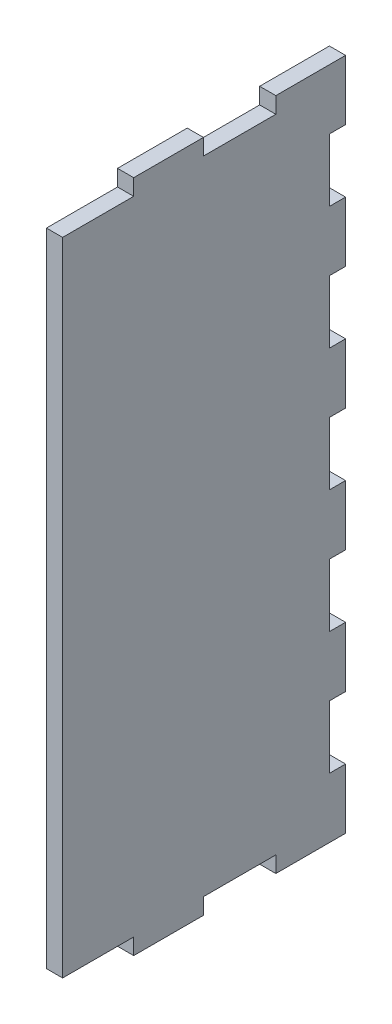
ISO-10303-21;
HEADER;
FILE_DESCRIPTION(('STEP AP214'),'2;1');
FILE_NAME('part.step','',(''),(''),'','','');
FILE_SCHEMA(('AUTOMOTIVE_DESIGN { 1 0 10303 214 1 1 1 1 }'));
ENDSEC;
DATA;
#1=APPLICATION_CONTEXT('core data for automotive mechanical design processes');
#2=APPLICATION_PROTOCOL_DEFINITION('international standard','automotive_design',2000,#1);
#3=PRODUCT_CONTEXT('',#1,'mechanical');
#4=PRODUCT('Part','Part','',(#3));
#5=PRODUCT_RELATED_PRODUCT_CATEGORY('part','',(#4));
#6=PRODUCT_DEFINITION_FORMATION('','',#4);
#7=PRODUCT_DEFINITION_CONTEXT('part definition',#1,'design');
#8=PRODUCT_DEFINITION('design','',#6,#7);
#9=PRODUCT_DEFINITION_SHAPE('','',#8);
#10=(LENGTH_UNIT() NAMED_UNIT(*) SI_UNIT(.MILLI.,.METRE.));
#11=(NAMED_UNIT(*) PLANE_ANGLE_UNIT() SI_UNIT($,.RADIAN.));
#12=(NAMED_UNIT(*) SI_UNIT($,.STERADIAN.) SOLID_ANGLE_UNIT());
#13=UNCERTAINTY_MEASURE_WITH_UNIT(LENGTH_MEASURE(1.E-05),#10,'distance_accuracy_value','');
#14=(GEOMETRIC_REPRESENTATION_CONTEXT(3) GLOBAL_UNCERTAINTY_ASSIGNED_CONTEXT((#13)) GLOBAL_UNIT_ASSIGNED_CONTEXT((#10,
#11,#12)) REPRESENTATION_CONTEXT('',''));
#15=CARTESIAN_POINT('',(0.,0.,0.));
#16=DIRECTION('',(0.,0.,1.));
#17=DIRECTION('',(1.,0.,0.));
#18=AXIS2_PLACEMENT_3D('',#15,#16,#17);
#19=CARTESIAN_POINT('',(324.,244.,25.875));
#20=DIRECTION('',(0.,1.,0.));
#21=DIRECTION('',(0.,0.,1.));
#22=AXIS2_PLACEMENT_3D('',#19,#20,#21);
#23=PLANE('',#22);
#24=DIRECTION('',(0.,0.,1.));
#25=VECTOR('',#24,1.);
#26=CARTESIAN_POINT('',(330.,244.,25.875));
#27=LINE('',#26,#25);
#28=CARTESIAN_POINT('',(330.,244.,25.875));
#29=VERTEX_POINT('',#28);
#30=CARTESIAN_POINT('',(330.,244.,52.75));
#31=VERTEX_POINT('',#30);
#32=EDGE_CURVE('E306',#29,#31,#27,.T.);
#33=ORIENTED_EDGE('',*,*,#32,.F.);
#34=DIRECTION('',(1.,0.,0.));
#35=VECTOR('',#34,1.);
#36=CARTESIAN_POINT('',(324.,244.,25.875));
#37=LINE('',#36,#35);
#38=CARTESIAN_POINT('',(324.,244.,25.875));
#39=VERTEX_POINT('',#38);
#40=EDGE_CURVE('E11',#39,#29,#37,.T.);
#41=ORIENTED_EDGE('',*,*,#40,.F.);
#42=DIRECTION('',(0.,0.,1.));
#43=VECTOR('',#42,1.);
#44=CARTESIAN_POINT('',(324.,244.,25.875));
#45=LINE('',#44,#43);
#46=CARTESIAN_POINT('',(324.,244.,52.75));
#47=VERTEX_POINT('',#46);
#48=EDGE_CURVE('E410',#39,#47,#45,.T.);
#49=ORIENTED_EDGE('',*,*,#48,.T.);
#50=DIRECTION('',(1.,0.,0.));
#51=VECTOR('',#50,1.);
#52=CARTESIAN_POINT('',(324.,244.,52.75));
#53=LINE('',#52,#51);
#54=EDGE_CURVE('E44',#47,#31,#53,.T.);
#55=ORIENTED_EDGE('',*,*,#54,.T.);
#56=EDGE_LOOP('',(#33,#41,#49,#55));
#57=FACE_BOUND('',#56,.T.);
#58=ADVANCED_FACE('F41',(#57),#23,.T.);
#59=CARTESIAN_POINT('',(324.,250.,25.875));
#60=DIRECTION('',(0.,0.,1.));
#61=DIRECTION('',(1.,0.,0.));
#62=AXIS2_PLACEMENT_3D('',#59,#60,#61);
#63=PLANE('',#62);
#64=DIRECTION('',(0.,-1.,0.));
#65=VECTOR('',#64,1.);
#66=CARTESIAN_POINT('',(330.,250.,25.875));
#67=LINE('',#66,#65);
#68=CARTESIAN_POINT('',(330.,250.,25.875));
#69=VERTEX_POINT('',#68);
#70=EDGE_CURVE('E408',#69,#29,#67,.T.);
#71=ORIENTED_EDGE('',*,*,#70,.F.);
#72=DIRECTION('',(1.,0.,0.));
#73=VECTOR('',#72,1.);
#74=CARTESIAN_POINT('',(324.,250.,25.875));
#75=LINE('',#74,#73);
#76=CARTESIAN_POINT('',(324.,250.,25.875));
#77=VERTEX_POINT('',#76);
#78=EDGE_CURVE('E50',#77,#69,#75,.T.);
#79=ORIENTED_EDGE('',*,*,#78,.F.);
#80=DIRECTION('',(0.,-1.,0.));
#81=VECTOR('',#80,1.);
#82=CARTESIAN_POINT('',(324.,250.,25.875));
#83=LINE('',#82,#81);
#84=EDGE_CURVE('E296',#77,#39,#83,.T.);
#85=ORIENTED_EDGE('',*,*,#84,.T.);
#86=ORIENTED_EDGE('',*,*,#40,.T.);
#87=EDGE_LOOP('',(#71,#79,#85,#86));
#88=FACE_BOUND('',#87,.T.);
#89=ADVANCED_FACE('F478',(#88),#63,.T.);
#90=CARTESIAN_POINT('',(324.,250.,0.));
#91=DIRECTION('',(0.,1.,0.));
#92=DIRECTION('',(0.,0.,1.));
#93=AXIS2_PLACEMENT_3D('',#90,#91,#92);
#94=PLANE('',#93);
#95=DIRECTION('',(0.,0.,1.));
#96=VECTOR('',#95,1.);
#97=CARTESIAN_POINT('',(330.,250.,0.));
#98=LINE('',#97,#96);
#99=CARTESIAN_POINT('',(330.,250.,0.));
#100=VERTEX_POINT('',#99);
#101=EDGE_CURVE('E283',#100,#69,#98,.T.);
#102=ORIENTED_EDGE('',*,*,#101,.F.);
#103=DIRECTION('',(1.,0.,0.));
#104=VECTOR('',#103,1.);
#105=CARTESIAN_POINT('',(324.,250.,0.));
#106=LINE('',#105,#104);
#107=CARTESIAN_POINT('',(324.,250.,0.));
#108=VERTEX_POINT('',#107);
#109=EDGE_CURVE('E278',#108,#100,#106,.T.);
#110=ORIENTED_EDGE('',*,*,#109,.F.);
#111=DIRECTION('',(0.,0.,1.));
#112=VECTOR('',#111,1.);
#113=CARTESIAN_POINT('',(324.,250.,0.));
#114=LINE('',#113,#112);
#115=EDGE_CURVE('E281',#108,#77,#114,.T.);
#116=ORIENTED_EDGE('',*,*,#115,.T.);
#117=ORIENTED_EDGE('',*,*,#78,.T.);
#118=EDGE_LOOP('',(#102,#110,#116,#117));
#119=FACE_BOUND('',#118,.T.);
#120=ADVANCED_FACE('F280',(#119),#94,.T.);
#121=CARTESIAN_POINT('',(324.,227.727272727273,0.));
#122=DIRECTION('',(0.,0.,-1.));
#123=DIRECTION('',(-1.,0.,0.));
#124=AXIS2_PLACEMENT_3D('',#121,#122,#123);
#125=PLANE('',#124);
#126=DIRECTION('',(0.,1.,0.));
#127=VECTOR('',#126,1.);
#128=CARTESIAN_POINT('',(330.,227.727272727273,0.));
#129=LINE('',#128,#127);
#130=CARTESIAN_POINT('',(330.,227.727272727273,0.));
#131=VERTEX_POINT('',#130);
#132=EDGE_CURVE('E405',#131,#100,#129,.T.);
#133=ORIENTED_EDGE('',*,*,#132,.F.);
#134=DIRECTION('',(1.,0.,0.));
#135=VECTOR('',#134,1.);
#136=CARTESIAN_POINT('',(324.,227.727272727273,0.));
#137=LINE('',#136,#135);
#138=CARTESIAN_POINT('',(324.,227.727272727273,0.));
#139=VERTEX_POINT('',#138);
#140=EDGE_CURVE('E288',#139,#131,#137,.T.);
#141=ORIENTED_EDGE('',*,*,#140,.F.);
#142=DIRECTION('',(0.,1.,0.));
#143=VECTOR('',#142,1.);
#144=CARTESIAN_POINT('',(324.,227.727272727273,0.));
#145=LINE('',#144,#143);
#146=EDGE_CURVE('E294',#139,#108,#145,.T.);
#147=ORIENTED_EDGE('',*,*,#146,.T.);
#148=ORIENTED_EDGE('',*,*,#109,.T.);
#149=EDGE_LOOP('',(#133,#141,#147,#148));
#150=FACE_BOUND('',#149,.T.);
#151=ADVANCED_FACE('F298',(#150),#125,.T.);
#152=CARTESIAN_POINT('',(324.,227.727272727273,6.));
#153=DIRECTION('',(0.,-1.,0.));
#154=DIRECTION('',(0.,0.,-1.));
#155=AXIS2_PLACEMENT_3D('',#152,#153,#154);
#156=PLANE('',#155);
#157=DIRECTION('',(0.,0.,-1.));
#158=VECTOR('',#157,1.);
#159=CARTESIAN_POINT('',(330.,227.727272727273,6.));
#160=LINE('',#159,#158);
#161=CARTESIAN_POINT('',(330.,227.727272727273,6.));
#162=VERTEX_POINT('',#161);
#163=EDGE_CURVE('E402',#162,#131,#160,.T.);
#164=ORIENTED_EDGE('',*,*,#163,.F.);
#165=DIRECTION('',(1.,0.,0.));
#166=VECTOR('',#165,1.);
#167=CARTESIAN_POINT('',(324.,227.727272727273,6.));
#168=LINE('',#167,#166);
#169=CARTESIAN_POINT('',(324.,227.727272727273,6.));
#170=VERTEX_POINT('',#169);
#171=EDGE_CURVE('E414',#170,#162,#168,.T.);
#172=ORIENTED_EDGE('',*,*,#171,.F.);
#173=DIRECTION('',(0.,0.,-1.));
#174=VECTOR('',#173,1.);
#175=CARTESIAN_POINT('',(324.,227.727272727273,6.));
#176=LINE('',#175,#174);
#177=EDGE_CURVE('E299',#170,#139,#176,.T.);
#178=ORIENTED_EDGE('',*,*,#177,.T.);
#179=ORIENTED_EDGE('',*,*,#140,.T.);
#180=EDGE_LOOP('',(#164,#172,#178,#179));
#181=FACE_BOUND('',#180,.T.);
#182=ADVANCED_FACE('F491',(#181),#156,.T.);
#183=CARTESIAN_POINT('',(324.,204.454545454545,6.));
#184=DIRECTION('',(0.,0.,-1.));
#185=DIRECTION('',(-1.,0.,0.));
#186=AXIS2_PLACEMENT_3D('',#183,#184,#185);
#187=PLANE('',#186);
#188=DIRECTION('',(0.,1.,0.));
#189=VECTOR('',#188,1.);
#190=CARTESIAN_POINT('',(330.,204.454545454545,6.));
#191=LINE('',#190,#189);
#192=CARTESIAN_POINT('',(330.,204.454545454545,6.));
#193=VERTEX_POINT('',#192);
#194=EDGE_CURVE('E399',#193,#162,#191,.T.);
#195=ORIENTED_EDGE('',*,*,#194,.F.);
#196=DIRECTION('',(1.,0.,0.));
#197=VECTOR('',#196,1.);
#198=CARTESIAN_POINT('',(324.,204.454545454545,6.));
#199=LINE('',#198,#197);
#200=CARTESIAN_POINT('',(324.,204.454545454545,6.));
#201=VERTEX_POINT('',#200);
#202=EDGE_CURVE('E416',#201,#193,#199,.T.);
#203=ORIENTED_EDGE('',*,*,#202,.F.);
#204=DIRECTION('',(0.,1.,0.));
#205=VECTOR('',#204,1.);
#206=CARTESIAN_POINT('',(324.,204.454545454545,6.));
#207=LINE('',#206,#205);
#208=EDGE_CURVE('E301',#201,#170,#207,.T.);
#209=ORIENTED_EDGE('',*,*,#208,.T.);
#210=ORIENTED_EDGE('',*,*,#171,.T.);
#211=EDGE_LOOP('',(#195,#203,#209,#210));
#212=FACE_BOUND('',#211,.T.);
#213=ADVANCED_FACE('F494',(#212),#187,.T.);
#214=CARTESIAN_POINT('',(324.,204.454545454545,0.));
#215=DIRECTION('',(0.,1.,0.));
#216=DIRECTION('',(0.,0.,1.));
#217=AXIS2_PLACEMENT_3D('',#214,#215,#216);
#218=PLANE('',#217);
#219=DIRECTION('',(0.,0.,1.));
#220=VECTOR('',#219,1.);
#221=CARTESIAN_POINT('',(330.,204.454545454545,0.));
#222=LINE('',#221,#220);
#223=CARTESIAN_POINT('',(330.,204.454545454545,0.));
#224=VERTEX_POINT('',#223);
#225=EDGE_CURVE('E396',#224,#193,#222,.T.);
#226=ORIENTED_EDGE('',*,*,#225,.F.);
#227=DIRECTION('',(1.,0.,0.));
#228=VECTOR('',#227,1.);
#229=CARTESIAN_POINT('',(324.,204.454545454545,0.));
#230=LINE('',#229,#228);
#231=CARTESIAN_POINT('',(324.,204.454545454545,0.));
#232=VERTEX_POINT('',#231);
#233=EDGE_CURVE('E418',#232,#224,#230,.T.);
#234=ORIENTED_EDGE('',*,*,#233,.F.);
#235=DIRECTION('',(0.,0.,1.));
#236=VECTOR('',#235,1.);
#237=CARTESIAN_POINT('',(324.,204.454545454545,0.));
#238=LINE('',#237,#236);
#239=EDGE_CURVE('E948',#232,#201,#238,.T.);
#240=ORIENTED_EDGE('',*,*,#239,.T.);
#241=ORIENTED_EDGE('',*,*,#202,.T.);
#242=EDGE_LOOP('',(#226,#234,#240,#241));
#243=FACE_BOUND('',#242,.T.);
#244=ADVANCED_FACE('F498',(#243),#218,.T.);
#245=CARTESIAN_POINT('',(324.,182.181818181818,0.));
#246=DIRECTION('',(0.,0.,-1.));
#247=DIRECTION('',(-1.,0.,0.));
#248=AXIS2_PLACEMENT_3D('',#245,#246,#247);
#249=PLANE('',#248);
#250=DIRECTION('',(0.,1.,0.));
#251=VECTOR('',#250,1.);
#252=CARTESIAN_POINT('',(330.,182.181818181818,0.));
#253=LINE('',#252,#251);
#254=CARTESIAN_POINT('',(330.,182.181818181818,0.));
#255=VERTEX_POINT('',#254);
#256=EDGE_CURVE('E393',#255,#224,#253,.T.);
#257=ORIENTED_EDGE('',*,*,#256,.F.);
#258=DIRECTION('',(1.,0.,0.));
#259=VECTOR('',#258,1.);
#260=CARTESIAN_POINT('',(324.,182.181818181818,0.));
#261=LINE('',#260,#259);
#262=CARTESIAN_POINT('',(324.,182.181818181818,0.));
#263=VERTEX_POINT('',#262);
#264=EDGE_CURVE('E420',#263,#255,#261,.T.);
#265=ORIENTED_EDGE('',*,*,#264,.F.);
#266=DIRECTION('',(0.,1.,0.));
#267=VECTOR('',#266,1.);
#268=CARTESIAN_POINT('',(324.,182.181818181818,0.));
#269=LINE('',#268,#267);
#270=EDGE_CURVE('E952',#263,#232,#269,.T.);
#271=ORIENTED_EDGE('',*,*,#270,.T.);
#272=ORIENTED_EDGE('',*,*,#233,.T.);
#273=EDGE_LOOP('',(#257,#265,#271,#272));
#274=FACE_BOUND('',#273,.T.);
#275=ADVANCED_FACE('F502',(#274),#249,.T.);
#276=CARTESIAN_POINT('',(324.,182.181818181818,6.));
#277=DIRECTION('',(0.,-1.,0.));
#278=DIRECTION('',(0.,0.,-1.));
#279=AXIS2_PLACEMENT_3D('',#276,#277,#278);
#280=PLANE('',#279);
#281=DIRECTION('',(0.,0.,-1.));
#282=VECTOR('',#281,1.);
#283=CARTESIAN_POINT('',(330.,182.181818181818,6.));
#284=LINE('',#283,#282);
#285=CARTESIAN_POINT('',(330.,182.181818181818,6.));
#286=VERTEX_POINT('',#285);
#287=EDGE_CURVE('E390',#286,#255,#284,.T.);
#288=ORIENTED_EDGE('',*,*,#287,.F.);
#289=DIRECTION('',(1.,0.,0.));
#290=VECTOR('',#289,1.);
#291=CARTESIAN_POINT('',(324.,182.181818181818,6.));
#292=LINE('',#291,#290);
#293=CARTESIAN_POINT('',(324.,182.181818181818,6.));
#294=VERTEX_POINT('',#293);
#295=EDGE_CURVE('E422',#294,#286,#292,.T.);
#296=ORIENTED_EDGE('',*,*,#295,.F.);
#297=DIRECTION('',(0.,0.,-1.));
#298=VECTOR('',#297,1.);
#299=CARTESIAN_POINT('',(324.,182.181818181818,6.));
#300=LINE('',#299,#298);
#301=EDGE_CURVE('E941',#294,#263,#300,.T.);
#302=ORIENTED_EDGE('',*,*,#301,.T.);
#303=ORIENTED_EDGE('',*,*,#264,.T.);
#304=EDGE_LOOP('',(#288,#296,#302,#303));
#305=FACE_BOUND('',#304,.T.);
#306=ADVANCED_FACE('F506',(#305),#280,.T.);
#307=CARTESIAN_POINT('',(324.,158.909090909091,6.));
#308=DIRECTION('',(0.,0.,-1.));
#309=DIRECTION('',(-1.,0.,0.));
#310=AXIS2_PLACEMENT_3D('',#307,#308,#309);
#311=PLANE('',#310);
#312=DIRECTION('',(0.,1.,0.));
#313=VECTOR('',#312,1.);
#314=CARTESIAN_POINT('',(330.,158.909090909091,6.));
#315=LINE('',#314,#313);
#316=CARTESIAN_POINT('',(330.,158.909090909091,6.));
#317=VERTEX_POINT('',#316);
#318=EDGE_CURVE('E387',#317,#286,#315,.T.);
#319=ORIENTED_EDGE('',*,*,#318,.F.);
#320=DIRECTION('',(1.,0.,0.));
#321=VECTOR('',#320,1.);
#322=CARTESIAN_POINT('',(324.,158.909090909091,6.));
#323=LINE('',#322,#321);
#324=CARTESIAN_POINT('',(324.,158.909090909091,6.));
#325=VERTEX_POINT('',#324);
#326=EDGE_CURVE('E424',#325,#317,#323,.T.);
#327=ORIENTED_EDGE('',*,*,#326,.F.);
#328=DIRECTION('',(0.,1.,0.));
#329=VECTOR('',#328,1.);
#330=CARTESIAN_POINT('',(324.,158.909090909091,6.));
#331=LINE('',#330,#329);
#332=EDGE_CURVE('E937',#325,#294,#331,.T.);
#333=ORIENTED_EDGE('',*,*,#332,.T.);
#334=ORIENTED_EDGE('',*,*,#295,.T.);
#335=EDGE_LOOP('',(#319,#327,#333,#334));
#336=FACE_BOUND('',#335,.T.);
#337=ADVANCED_FACE('F510',(#336),#311,.T.);
#338=CARTESIAN_POINT('',(324.,158.909090909091,0.));
#339=DIRECTION('',(0.,1.,0.));
#340=DIRECTION('',(0.,0.,1.));
#341=AXIS2_PLACEMENT_3D('',#338,#339,#340);
#342=PLANE('',#341);
#343=DIRECTION('',(0.,0.,1.));
#344=VECTOR('',#343,1.);
#345=CARTESIAN_POINT('',(330.,158.909090909091,0.));
#346=LINE('',#345,#344);
#347=CARTESIAN_POINT('',(330.,158.909090909091,0.));
#348=VERTEX_POINT('',#347);
#349=EDGE_CURVE('E384',#348,#317,#346,.T.);
#350=ORIENTED_EDGE('',*,*,#349,.F.);
#351=DIRECTION('',(1.,0.,0.));
#352=VECTOR('',#351,1.);
#353=CARTESIAN_POINT('',(324.,158.909090909091,0.));
#354=LINE('',#353,#352);
#355=CARTESIAN_POINT('',(324.,158.909090909091,0.));
#356=VERTEX_POINT('',#355);
#357=EDGE_CURVE('E426',#356,#348,#354,.T.);
#358=ORIENTED_EDGE('',*,*,#357,.F.);
#359=DIRECTION('',(0.,0.,1.));
#360=VECTOR('',#359,1.);
#361=CARTESIAN_POINT('',(324.,158.909090909091,0.));
#362=LINE('',#361,#360);
#363=EDGE_CURVE('E958',#356,#325,#362,.T.);
#364=ORIENTED_EDGE('',*,*,#363,.T.);
#365=ORIENTED_EDGE('',*,*,#326,.T.);
#366=EDGE_LOOP('',(#350,#358,#364,#365));
#367=FACE_BOUND('',#366,.T.);
#368=ADVANCED_FACE('F514',(#367),#342,.T.);
#369=CARTESIAN_POINT('',(324.,136.636363636364,0.));
#370=DIRECTION('',(0.,0.,-1.));
#371=DIRECTION('',(-1.,0.,0.));
#372=AXIS2_PLACEMENT_3D('',#369,#370,#371);
#373=PLANE('',#372);
#374=DIRECTION('',(0.,1.,0.));
#375=VECTOR('',#374,1.);
#376=CARTESIAN_POINT('',(330.,136.636363636364,0.));
#377=LINE('',#376,#375);
#378=CARTESIAN_POINT('',(330.,136.636363636364,0.));
#379=VERTEX_POINT('',#378);
#380=EDGE_CURVE('E381',#379,#348,#377,.T.);
#381=ORIENTED_EDGE('',*,*,#380,.F.);
#382=DIRECTION('',(1.,0.,0.));
#383=VECTOR('',#382,1.);
#384=CARTESIAN_POINT('',(324.,136.636363636364,0.));
#385=LINE('',#384,#383);
#386=CARTESIAN_POINT('',(324.,136.636363636364,0.));
#387=VERTEX_POINT('',#386);
#388=EDGE_CURVE('E428',#387,#379,#385,.T.);
#389=ORIENTED_EDGE('',*,*,#388,.F.);
#390=DIRECTION('',(0.,1.,0.));
#391=VECTOR('',#390,1.);
#392=CARTESIAN_POINT('',(324.,136.636363636364,0.));
#393=LINE('',#392,#391);
#394=EDGE_CURVE('E930',#387,#356,#393,.T.);
#395=ORIENTED_EDGE('',*,*,#394,.T.);
#396=ORIENTED_EDGE('',*,*,#357,.T.);
#397=EDGE_LOOP('',(#381,#389,#395,#396));
#398=FACE_BOUND('',#397,.T.);
#399=ADVANCED_FACE('F518',(#398),#373,.T.);
#400=CARTESIAN_POINT('',(324.,136.636363636364,6.));
#401=DIRECTION('',(0.,-1.,0.));
#402=DIRECTION('',(0.,0.,-1.));
#403=AXIS2_PLACEMENT_3D('',#400,#401,#402);
#404=PLANE('',#403);
#405=DIRECTION('',(0.,0.,-1.));
#406=VECTOR('',#405,1.);
#407=CARTESIAN_POINT('',(330.,136.636363636364,6.));
#408=LINE('',#407,#406);
#409=CARTESIAN_POINT('',(330.,136.636363636364,6.));
#410=VERTEX_POINT('',#409);
#411=EDGE_CURVE('E378',#410,#379,#408,.T.);
#412=ORIENTED_EDGE('',*,*,#411,.F.);
#413=DIRECTION('',(1.,0.,0.));
#414=VECTOR('',#413,1.);
#415=CARTESIAN_POINT('',(324.,136.636363636364,6.));
#416=LINE('',#415,#414);
#417=CARTESIAN_POINT('',(324.,136.636363636364,6.));
#418=VERTEX_POINT('',#417);
#419=EDGE_CURVE('E430',#418,#410,#416,.T.);
#420=ORIENTED_EDGE('',*,*,#419,.F.);
#421=DIRECTION('',(0.,0.,-1.));
#422=VECTOR('',#421,1.);
#423=CARTESIAN_POINT('',(324.,136.636363636364,6.));
#424=LINE('',#423,#422);
#425=EDGE_CURVE('E926',#418,#387,#424,.T.);
#426=ORIENTED_EDGE('',*,*,#425,.T.);
#427=ORIENTED_EDGE('',*,*,#388,.T.);
#428=EDGE_LOOP('',(#412,#420,#426,#427));
#429=FACE_BOUND('',#428,.T.);
#430=ADVANCED_FACE('F522',(#429),#404,.T.);
#431=CARTESIAN_POINT('',(324.,113.363636363636,6.));
#432=DIRECTION('',(0.,0.,-1.));
#433=DIRECTION('',(-1.,0.,0.));
#434=AXIS2_PLACEMENT_3D('',#431,#432,#433);
#435=PLANE('',#434);
#436=DIRECTION('',(0.,1.,0.));
#437=VECTOR('',#436,1.);
#438=CARTESIAN_POINT('',(330.,113.363636363636,6.));
#439=LINE('',#438,#437);
#440=CARTESIAN_POINT('',(330.,113.363636363636,6.));
#441=VERTEX_POINT('',#440);
#442=EDGE_CURVE('E375',#441,#410,#439,.T.);
#443=ORIENTED_EDGE('',*,*,#442,.F.);
#444=DIRECTION('',(1.,0.,0.));
#445=VECTOR('',#444,1.);
#446=CARTESIAN_POINT('',(324.,113.363636363636,6.));
#447=LINE('',#446,#445);
#448=CARTESIAN_POINT('',(324.,113.363636363636,6.));
#449=VERTEX_POINT('',#448);
#450=EDGE_CURVE('E432',#449,#441,#447,.T.);
#451=ORIENTED_EDGE('',*,*,#450,.F.);
#452=DIRECTION('',(0.,1.,0.));
#453=VECTOR('',#452,1.);
#454=CARTESIAN_POINT('',(324.,113.363636363636,6.));
#455=LINE('',#454,#453);
#456=EDGE_CURVE('E962',#449,#418,#455,.T.);
#457=ORIENTED_EDGE('',*,*,#456,.T.);
#458=ORIENTED_EDGE('',*,*,#419,.T.);
#459=EDGE_LOOP('',(#443,#451,#457,#458));
#460=FACE_BOUND('',#459,.T.);
#461=ADVANCED_FACE('F526',(#460),#435,.T.);
#462=CARTESIAN_POINT('',(324.,113.363636363636,0.));
#463=DIRECTION('',(0.,1.,0.));
#464=DIRECTION('',(0.,0.,1.));
#465=AXIS2_PLACEMENT_3D('',#462,#463,#464);
#466=PLANE('',#465);
#467=DIRECTION('',(0.,0.,1.));
#468=VECTOR('',#467,1.);
#469=CARTESIAN_POINT('',(330.,113.363636363636,0.));
#470=LINE('',#469,#468);
#471=CARTESIAN_POINT('',(330.,113.363636363636,0.));
#472=VERTEX_POINT('',#471);
#473=EDGE_CURVE('E372',#472,#441,#470,.T.);
#474=ORIENTED_EDGE('',*,*,#473,.F.);
#475=DIRECTION('',(1.,0.,0.));
#476=VECTOR('',#475,1.);
#477=CARTESIAN_POINT('',(324.,113.363636363636,0.));
#478=LINE('',#477,#476);
#479=CARTESIAN_POINT('',(324.,113.363636363636,0.));
#480=VERTEX_POINT('',#479);
#481=EDGE_CURVE('E434',#480,#472,#478,.T.);
#482=ORIENTED_EDGE('',*,*,#481,.F.);
#483=DIRECTION('',(0.,0.,1.));
#484=VECTOR('',#483,1.);
#485=CARTESIAN_POINT('',(324.,113.363636363636,0.));
#486=LINE('',#485,#484);
#487=EDGE_CURVE('E919',#480,#449,#486,.T.);
#488=ORIENTED_EDGE('',*,*,#487,.T.);
#489=ORIENTED_EDGE('',*,*,#450,.T.);
#490=EDGE_LOOP('',(#474,#482,#488,#489));
#491=FACE_BOUND('',#490,.T.);
#492=ADVANCED_FACE('F530',(#491),#466,.T.);
#493=CARTESIAN_POINT('',(324.,91.0909090909091,0.));
#494=DIRECTION('',(0.,0.,-1.));
#495=DIRECTION('',(-1.,0.,0.));
#496=AXIS2_PLACEMENT_3D('',#493,#494,#495);
#497=PLANE('',#496);
#498=DIRECTION('',(0.,1.,0.));
#499=VECTOR('',#498,1.);
#500=CARTESIAN_POINT('',(330.,91.0909090909091,0.));
#501=LINE('',#500,#499);
#502=CARTESIAN_POINT('',(330.,91.0909090909091,0.));
#503=VERTEX_POINT('',#502);
#504=EDGE_CURVE('E369',#503,#472,#501,.T.);
#505=ORIENTED_EDGE('',*,*,#504,.F.);
#506=DIRECTION('',(1.,0.,0.));
#507=VECTOR('',#506,1.);
#508=CARTESIAN_POINT('',(324.,91.0909090909091,0.));
#509=LINE('',#508,#507);
#510=CARTESIAN_POINT('',(324.,91.0909090909091,0.));
#511=VERTEX_POINT('',#510);
#512=EDGE_CURVE('E436',#511,#503,#509,.T.);
#513=ORIENTED_EDGE('',*,*,#512,.F.);
#514=DIRECTION('',(0.,1.,0.));
#515=VECTOR('',#514,1.);
#516=CARTESIAN_POINT('',(324.,91.0909090909091,0.));
#517=LINE('',#516,#515);
#518=EDGE_CURVE('E915',#511,#480,#517,.T.);
#519=ORIENTED_EDGE('',*,*,#518,.T.);
#520=ORIENTED_EDGE('',*,*,#481,.T.);
#521=EDGE_LOOP('',(#505,#513,#519,#520));
#522=FACE_BOUND('',#521,.T.);
#523=ADVANCED_FACE('F534',(#522),#497,.T.);
#524=CARTESIAN_POINT('',(324.,91.0909090909091,6.));
#525=DIRECTION('',(0.,-1.,0.));
#526=DIRECTION('',(0.,0.,-1.));
#527=AXIS2_PLACEMENT_3D('',#524,#525,#526);
#528=PLANE('',#527);
#529=DIRECTION('',(0.,0.,-1.));
#530=VECTOR('',#529,1.);
#531=CARTESIAN_POINT('',(330.,91.0909090909091,6.));
#532=LINE('',#531,#530);
#533=CARTESIAN_POINT('',(330.,91.0909090909091,6.));
#534=VERTEX_POINT('',#533);
#535=EDGE_CURVE('E366',#534,#503,#532,.T.);
#536=ORIENTED_EDGE('',*,*,#535,.F.);
#537=DIRECTION('',(1.,0.,0.));
#538=VECTOR('',#537,1.);
#539=CARTESIAN_POINT('',(324.,91.0909090909091,6.));
#540=LINE('',#539,#538);
#541=CARTESIAN_POINT('',(324.,91.0909090909091,6.));
#542=VERTEX_POINT('',#541);
#543=EDGE_CURVE('E438',#542,#534,#540,.T.);
#544=ORIENTED_EDGE('',*,*,#543,.F.);
#545=DIRECTION('',(0.,0.,-1.));
#546=VECTOR('',#545,1.);
#547=CARTESIAN_POINT('',(324.,91.0909090909091,6.));
#548=LINE('',#547,#546);
#549=EDGE_CURVE('E966',#542,#511,#548,.T.);
#550=ORIENTED_EDGE('',*,*,#549,.T.);
#551=ORIENTED_EDGE('',*,*,#512,.T.);
#552=EDGE_LOOP('',(#536,#544,#550,#551));
#553=FACE_BOUND('',#552,.T.);
#554=ADVANCED_FACE('F538',(#553),#528,.T.);
#555=CARTESIAN_POINT('',(324.,67.8181818181818,6.));
#556=DIRECTION('',(0.,0.,-1.));
#557=DIRECTION('',(-1.,0.,0.));
#558=AXIS2_PLACEMENT_3D('',#555,#556,#557);
#559=PLANE('',#558);
#560=DIRECTION('',(0.,1.,0.));
#561=VECTOR('',#560,1.);
#562=CARTESIAN_POINT('',(330.,67.8181818181818,6.));
#563=LINE('',#562,#561);
#564=CARTESIAN_POINT('',(330.,67.8181818181818,6.));
#565=VERTEX_POINT('',#564);
#566=EDGE_CURVE('E363',#565,#534,#563,.T.);
#567=ORIENTED_EDGE('',*,*,#566,.F.);
#568=DIRECTION('',(1.,0.,0.));
#569=VECTOR('',#568,1.);
#570=CARTESIAN_POINT('',(324.,67.8181818181818,6.));
#571=LINE('',#570,#569);
#572=CARTESIAN_POINT('',(324.,67.8181818181818,6.));
#573=VERTEX_POINT('',#572);
#574=EDGE_CURVE('E440',#573,#565,#571,.T.);
#575=ORIENTED_EDGE('',*,*,#574,.F.);
#576=DIRECTION('',(0.,1.,0.));
#577=VECTOR('',#576,1.);
#578=CARTESIAN_POINT('',(324.,67.8181818181818,6.));
#579=LINE('',#578,#577);
#580=EDGE_CURVE('E908',#573,#542,#579,.T.);
#581=ORIENTED_EDGE('',*,*,#580,.T.);
#582=ORIENTED_EDGE('',*,*,#543,.T.);
#583=EDGE_LOOP('',(#567,#575,#581,#582));
#584=FACE_BOUND('',#583,.T.);
#585=ADVANCED_FACE('F542',(#584),#559,.T.);
#586=CARTESIAN_POINT('',(324.,67.8181818181818,0.));
#587=DIRECTION('',(0.,1.,0.));
#588=DIRECTION('',(0.,0.,1.));
#589=AXIS2_PLACEMENT_3D('',#586,#587,#588);
#590=PLANE('',#589);
#591=DIRECTION('',(0.,0.,1.));
#592=VECTOR('',#591,1.);
#593=CARTESIAN_POINT('',(330.,67.8181818181818,0.));
#594=LINE('',#593,#592);
#595=CARTESIAN_POINT('',(330.,67.8181818181818,0.));
#596=VERTEX_POINT('',#595);
#597=EDGE_CURVE('E360',#596,#565,#594,.T.);
#598=ORIENTED_EDGE('',*,*,#597,.F.);
#599=DIRECTION('',(1.,0.,0.));
#600=VECTOR('',#599,1.);
#601=CARTESIAN_POINT('',(324.,67.8181818181818,0.));
#602=LINE('',#601,#600);
#603=CARTESIAN_POINT('',(324.,67.8181818181818,0.));
#604=VERTEX_POINT('',#603);
#605=EDGE_CURVE('E442',#604,#596,#602,.T.);
#606=ORIENTED_EDGE('',*,*,#605,.F.);
#607=DIRECTION('',(0.,0.,1.));
#608=VECTOR('',#607,1.);
#609=CARTESIAN_POINT('',(324.,67.8181818181818,0.));
#610=LINE('',#609,#608);
#611=EDGE_CURVE('E904',#604,#573,#610,.T.);
#612=ORIENTED_EDGE('',*,*,#611,.T.);
#613=ORIENTED_EDGE('',*,*,#574,.T.);
#614=EDGE_LOOP('',(#598,#606,#612,#613));
#615=FACE_BOUND('',#614,.T.);
#616=ADVANCED_FACE('F546',(#615),#590,.T.);
#617=CARTESIAN_POINT('',(324.,45.5454545454545,0.));
#618=DIRECTION('',(0.,0.,-1.));
#619=DIRECTION('',(-1.,0.,0.));
#620=AXIS2_PLACEMENT_3D('',#617,#618,#619);
#621=PLANE('',#620);
#622=DIRECTION('',(0.,1.,0.));
#623=VECTOR('',#622,1.);
#624=CARTESIAN_POINT('',(330.,45.5454545454545,0.));
#625=LINE('',#624,#623);
#626=CARTESIAN_POINT('',(330.,45.5454545454545,0.));
#627=VERTEX_POINT('',#626);
#628=EDGE_CURVE('E357',#627,#596,#625,.T.);
#629=ORIENTED_EDGE('',*,*,#628,.F.);
#630=DIRECTION('',(1.,0.,0.));
#631=VECTOR('',#630,1.);
#632=CARTESIAN_POINT('',(324.,45.5454545454545,0.));
#633=LINE('',#632,#631);
#634=CARTESIAN_POINT('',(324.,45.5454545454545,0.));
#635=VERTEX_POINT('',#634);
#636=EDGE_CURVE('E444',#635,#627,#633,.T.);
#637=ORIENTED_EDGE('',*,*,#636,.F.);
#638=DIRECTION('',(0.,1.,0.));
#639=VECTOR('',#638,1.);
#640=CARTESIAN_POINT('',(324.,45.5454545454545,0.));
#641=LINE('',#640,#639);
#642=EDGE_CURVE('E970',#635,#604,#641,.T.);
#643=ORIENTED_EDGE('',*,*,#642,.T.);
#644=ORIENTED_EDGE('',*,*,#605,.T.);
#645=EDGE_LOOP('',(#629,#637,#643,#644));
#646=FACE_BOUND('',#645,.T.);
#647=ADVANCED_FACE('F550',(#646),#621,.T.);
#648=CARTESIAN_POINT('',(324.,45.5454545454545,6.));
#649=DIRECTION('',(0.,-1.,0.));
#650=DIRECTION('',(0.,0.,-1.));
#651=AXIS2_PLACEMENT_3D('',#648,#649,#650);
#652=PLANE('',#651);
#653=DIRECTION('',(0.,0.,-1.));
#654=VECTOR('',#653,1.);
#655=CARTESIAN_POINT('',(330.,45.5454545454545,6.));
#656=LINE('',#655,#654);
#657=CARTESIAN_POINT('',(330.,45.5454545454545,6.));
#658=VERTEX_POINT('',#657);
#659=EDGE_CURVE('E354',#658,#627,#656,.T.);
#660=ORIENTED_EDGE('',*,*,#659,.F.);
#661=DIRECTION('',(1.,0.,0.));
#662=VECTOR('',#661,1.);
#663=CARTESIAN_POINT('',(324.,45.5454545454545,6.));
#664=LINE('',#663,#662);
#665=CARTESIAN_POINT('',(324.,45.5454545454545,6.));
#666=VERTEX_POINT('',#665);
#667=EDGE_CURVE('E446',#666,#658,#664,.T.);
#668=ORIENTED_EDGE('',*,*,#667,.F.);
#669=DIRECTION('',(0.,0.,-1.));
#670=VECTOR('',#669,1.);
#671=CARTESIAN_POINT('',(324.,45.5454545454545,6.));
#672=LINE('',#671,#670);
#673=EDGE_CURVE('E897',#666,#635,#672,.T.);
#674=ORIENTED_EDGE('',*,*,#673,.T.);
#675=ORIENTED_EDGE('',*,*,#636,.T.);
#676=EDGE_LOOP('',(#660,#668,#674,#675));
#677=FACE_BOUND('',#676,.T.);
#678=ADVANCED_FACE('F554',(#677),#652,.T.);
#679=CARTESIAN_POINT('',(324.,22.2727272727273,6.));
#680=DIRECTION('',(0.,0.,-1.));
#681=DIRECTION('',(-1.,0.,0.));
#682=AXIS2_PLACEMENT_3D('',#679,#680,#681);
#683=PLANE('',#682);
#684=DIRECTION('',(0.,1.,0.));
#685=VECTOR('',#684,1.);
#686=CARTESIAN_POINT('',(330.,22.2727272727273,6.));
#687=LINE('',#686,#685);
#688=CARTESIAN_POINT('',(330.,22.2727272727273,6.));
#689=VERTEX_POINT('',#688);
#690=EDGE_CURVE('E351',#689,#658,#687,.T.);
#691=ORIENTED_EDGE('',*,*,#690,.F.);
#692=DIRECTION('',(1.,0.,0.));
#693=VECTOR('',#692,1.);
#694=CARTESIAN_POINT('',(324.,22.2727272727273,6.));
#695=LINE('',#694,#693);
#696=CARTESIAN_POINT('',(324.,22.2727272727273,6.));
#697=VERTEX_POINT('',#696);
#698=EDGE_CURVE('E448',#697,#689,#695,.T.);
#699=ORIENTED_EDGE('',*,*,#698,.F.);
#700=DIRECTION('',(0.,1.,0.));
#701=VECTOR('',#700,1.);
#702=CARTESIAN_POINT('',(324.,22.2727272727273,6.));
#703=LINE('',#702,#701);
#704=EDGE_CURVE('E893',#697,#666,#703,.T.);
#705=ORIENTED_EDGE('',*,*,#704,.T.);
#706=ORIENTED_EDGE('',*,*,#667,.T.);
#707=EDGE_LOOP('',(#691,#699,#705,#706));
#708=FACE_BOUND('',#707,.T.);
#709=ADVANCED_FACE('F558',(#708),#683,.T.);
#710=CARTESIAN_POINT('',(324.,22.2727272727273,0.));
#711=DIRECTION('',(0.,1.,0.));
#712=DIRECTION('',(0.,0.,1.));
#713=AXIS2_PLACEMENT_3D('',#710,#711,#712);
#714=PLANE('',#713);
#715=DIRECTION('',(0.,0.,1.));
#716=VECTOR('',#715,1.);
#717=CARTESIAN_POINT('',(330.,22.2727272727273,0.));
#718=LINE('',#717,#716);
#719=CARTESIAN_POINT('',(330.,22.2727272727273,0.));
#720=VERTEX_POINT('',#719);
#721=EDGE_CURVE('E348',#720,#689,#718,.T.);
#722=ORIENTED_EDGE('',*,*,#721,.F.);
#723=DIRECTION('',(1.,0.,0.));
#724=VECTOR('',#723,1.);
#725=CARTESIAN_POINT('',(324.,22.2727272727273,0.));
#726=LINE('',#725,#724);
#727=CARTESIAN_POINT('',(324.,22.2727272727273,0.));
#728=VERTEX_POINT('',#727);
#729=EDGE_CURVE('E450',#728,#720,#726,.T.);
#730=ORIENTED_EDGE('',*,*,#729,.F.);
#731=DIRECTION('',(0.,0.,1.));
#732=VECTOR('',#731,1.);
#733=CARTESIAN_POINT('',(324.,22.2727272727273,0.));
#734=LINE('',#733,#732);
#735=EDGE_CURVE('E974',#728,#697,#734,.T.);
#736=ORIENTED_EDGE('',*,*,#735,.T.);
#737=ORIENTED_EDGE('',*,*,#698,.T.);
#738=EDGE_LOOP('',(#722,#730,#736,#737));
#739=FACE_BOUND('',#738,.T.);
#740=ADVANCED_FACE('F562',(#739),#714,.T.);
#741=CARTESIAN_POINT('',(324.,0.,0.));
#742=DIRECTION('',(0.,0.,-1.));
#743=DIRECTION('',(-1.,0.,0.));
#744=AXIS2_PLACEMENT_3D('',#741,#742,#743);
#745=PLANE('',#744);
#746=DIRECTION('',(0.,1.,0.));
#747=VECTOR('',#746,1.);
#748=CARTESIAN_POINT('',(330.,0.,0.));
#749=LINE('',#748,#747);
#750=CARTESIAN_POINT('',(330.,0.,0.));
#751=VERTEX_POINT('',#750);
#752=EDGE_CURVE('E345',#751,#720,#749,.T.);
#753=ORIENTED_EDGE('',*,*,#752,.F.);
#754=DIRECTION('',(1.,0.,0.));
#755=VECTOR('',#754,1.);
#756=CARTESIAN_POINT('',(324.,0.,0.));
#757=LINE('',#756,#755);
#758=CARTESIAN_POINT('',(324.,0.,0.));
#759=VERTEX_POINT('',#758);
#760=EDGE_CURVE('E452',#759,#751,#757,.T.);
#761=ORIENTED_EDGE('',*,*,#760,.F.);
#762=DIRECTION('',(0.,1.,0.));
#763=VECTOR('',#762,1.);
#764=CARTESIAN_POINT('',(324.,0.,0.));
#765=LINE('',#764,#763);
#766=EDGE_CURVE('E886',#759,#728,#765,.T.);
#767=ORIENTED_EDGE('',*,*,#766,.T.);
#768=ORIENTED_EDGE('',*,*,#729,.T.);
#769=EDGE_LOOP('',(#753,#761,#767,#768));
#770=FACE_BOUND('',#769,.T.);
#771=ADVANCED_FACE('F566',(#770),#745,.T.);
#772=CARTESIAN_POINT('',(324.,0.,25.875));
#773=DIRECTION('',(0.,-1.,0.));
#774=DIRECTION('',(0.,0.,-1.));
#775=AXIS2_PLACEMENT_3D('',#772,#773,#774);
#776=PLANE('',#775);
#777=DIRECTION('',(0.,0.,-1.));
#778=VECTOR('',#777,1.);
#779=CARTESIAN_POINT('',(330.,0.,25.875));
#780=LINE('',#779,#778);
#781=CARTESIAN_POINT('',(330.,0.,25.875));
#782=VERTEX_POINT('',#781);
#783=EDGE_CURVE('E342',#782,#751,#780,.T.);
#784=ORIENTED_EDGE('',*,*,#783,.F.);
#785=DIRECTION('',(1.,0.,0.));
#786=VECTOR('',#785,1.);
#787=CARTESIAN_POINT('',(324.,0.,25.875));
#788=LINE('',#787,#786);
#789=CARTESIAN_POINT('',(324.,0.,25.875));
#790=VERTEX_POINT('',#789);
#791=EDGE_CURVE('E454',#790,#782,#788,.T.);
#792=ORIENTED_EDGE('',*,*,#791,.F.);
#793=DIRECTION('',(0.,0.,-1.));
#794=VECTOR('',#793,1.);
#795=CARTESIAN_POINT('',(324.,0.,25.875));
#796=LINE('',#795,#794);
#797=EDGE_CURVE('E882',#790,#759,#796,.T.);
#798=ORIENTED_EDGE('',*,*,#797,.T.);
#799=ORIENTED_EDGE('',*,*,#760,.T.);
#800=EDGE_LOOP('',(#784,#792,#798,#799));
#801=FACE_BOUND('',#800,.T.);
#802=ADVANCED_FACE('F570',(#801),#776,.T.);
#803=CARTESIAN_POINT('',(324.,6.,25.875));
#804=DIRECTION('',(0.,0.,1.));
#805=DIRECTION('',(1.,0.,0.));
#806=AXIS2_PLACEMENT_3D('',#803,#804,#805);
#807=PLANE('',#806);
#808=DIRECTION('',(0.,-1.,0.));
#809=VECTOR('',#808,1.);
#810=CARTESIAN_POINT('',(330.,6.,25.875));
#811=LINE('',#810,#809);
#812=CARTESIAN_POINT('',(330.,6.,25.875));
#813=VERTEX_POINT('',#812);
#814=EDGE_CURVE('E339',#813,#782,#811,.T.);
#815=ORIENTED_EDGE('',*,*,#814,.F.);
#816=DIRECTION('',(1.,0.,0.));
#817=VECTOR('',#816,1.);
#818=CARTESIAN_POINT('',(324.,6.,25.875));
#819=LINE('',#818,#817);
#820=CARTESIAN_POINT('',(324.,6.,25.875));
#821=VERTEX_POINT('',#820);
#822=EDGE_CURVE('E456',#821,#813,#819,.T.);
#823=ORIENTED_EDGE('',*,*,#822,.F.);
#824=DIRECTION('',(0.,-1.,0.));
#825=VECTOR('',#824,1.);
#826=CARTESIAN_POINT('',(324.,6.,25.875));
#827=LINE('',#826,#825);
#828=EDGE_CURVE('E978',#821,#790,#827,.T.);
#829=ORIENTED_EDGE('',*,*,#828,.T.);
#830=ORIENTED_EDGE('',*,*,#791,.T.);
#831=EDGE_LOOP('',(#815,#823,#829,#830));
#832=FACE_BOUND('',#831,.T.);
#833=ADVANCED_FACE('F574',(#832),#807,.T.);
#834=CARTESIAN_POINT('',(324.,6.,52.75));
#835=DIRECTION('',(0.,-1.,0.));
#836=DIRECTION('',(0.,0.,-1.));
#837=AXIS2_PLACEMENT_3D('',#834,#835,#836);
#838=PLANE('',#837);
#839=DIRECTION('',(0.,0.,-1.));
#840=VECTOR('',#839,1.);
#841=CARTESIAN_POINT('',(330.,6.,52.75));
#842=LINE('',#841,#840);
#843=CARTESIAN_POINT('',(330.,6.,52.75));
#844=VERTEX_POINT('',#843);
#845=EDGE_CURVE('E336',#844,#813,#842,.T.);
#846=ORIENTED_EDGE('',*,*,#845,.F.);
#847=DIRECTION('',(1.,0.,0.));
#848=VECTOR('',#847,1.);
#849=CARTESIAN_POINT('',(324.,6.,52.75));
#850=LINE('',#849,#848);
#851=CARTESIAN_POINT('',(324.,6.,52.75));
#852=VERTEX_POINT('',#851);
#853=EDGE_CURVE('E458',#852,#844,#850,.T.);
#854=ORIENTED_EDGE('',*,*,#853,.F.);
#855=DIRECTION('',(0.,0.,-1.));
#856=VECTOR('',#855,1.);
#857=CARTESIAN_POINT('',(324.,6.,52.75));
#858=LINE('',#857,#856);
#859=EDGE_CURVE('E875',#852,#821,#858,.T.);
#860=ORIENTED_EDGE('',*,*,#859,.T.);
#861=ORIENTED_EDGE('',*,*,#822,.T.);
#862=EDGE_LOOP('',(#846,#854,#860,#861));
#863=FACE_BOUND('',#862,.T.);
#864=ADVANCED_FACE('F578',(#863),#838,.T.);
#865=CARTESIAN_POINT('',(324.,0.,52.75));
#866=DIRECTION('',(0.,0.,-1.));
#867=DIRECTION('',(-1.,0.,0.));
#868=AXIS2_PLACEMENT_3D('',#865,#866,#867);
#869=PLANE('',#868);
#870=DIRECTION('',(0.,1.,0.));
#871=VECTOR('',#870,1.);
#872=CARTESIAN_POINT('',(330.,0.,52.75));
#873=LINE('',#872,#871);
#874=CARTESIAN_POINT('',(330.,0.,52.75));
#875=VERTEX_POINT('',#874);
#876=EDGE_CURVE('E333',#875,#844,#873,.T.);
#877=ORIENTED_EDGE('',*,*,#876,.F.);
#878=DIRECTION('',(1.,0.,0.));
#879=VECTOR('',#878,1.);
#880=CARTESIAN_POINT('',(324.,0.,52.75));
#881=LINE('',#880,#879);
#882=CARTESIAN_POINT('',(324.,0.,52.75));
#883=VERTEX_POINT('',#882);
#884=EDGE_CURVE('E460',#883,#875,#881,.T.);
#885=ORIENTED_EDGE('',*,*,#884,.F.);
#886=DIRECTION('',(0.,1.,0.));
#887=VECTOR('',#886,1.);
#888=CARTESIAN_POINT('',(324.,0.,52.75));
#889=LINE('',#888,#887);
#890=EDGE_CURVE('E871',#883,#852,#889,.T.);
#891=ORIENTED_EDGE('',*,*,#890,.T.);
#892=ORIENTED_EDGE('',*,*,#853,.T.);
#893=EDGE_LOOP('',(#877,#885,#891,#892));
#894=FACE_BOUND('',#893,.T.);
#895=ADVANCED_FACE('F582',(#894),#869,.T.);
#896=CARTESIAN_POINT('',(324.,0.,78.625));
#897=DIRECTION('',(0.,-1.,0.));
#898=DIRECTION('',(0.,0.,-1.));
#899=AXIS2_PLACEMENT_3D('',#896,#897,#898);
#900=PLANE('',#899);
#901=DIRECTION('',(0.,0.,-1.));
#902=VECTOR('',#901,1.);
#903=CARTESIAN_POINT('',(330.,0.,78.625));
#904=LINE('',#903,#902);
#905=CARTESIAN_POINT('',(330.,0.,78.625));
#906=VERTEX_POINT('',#905);
#907=EDGE_CURVE('E330',#906,#875,#904,.T.);
#908=ORIENTED_EDGE('',*,*,#907,.F.);
#909=DIRECTION('',(1.,0.,0.));
#910=VECTOR('',#909,1.);
#911=CARTESIAN_POINT('',(324.,0.,78.625));
#912=LINE('',#911,#910);
#913=CARTESIAN_POINT('',(324.,0.,78.625));
#914=VERTEX_POINT('',#913);
#915=EDGE_CURVE('E462',#914,#906,#912,.T.);
#916=ORIENTED_EDGE('',*,*,#915,.F.);
#917=DIRECTION('',(0.,0.,-1.));
#918=VECTOR('',#917,1.);
#919=CARTESIAN_POINT('',(324.,0.,78.625));
#920=LINE('',#919,#918);
#921=EDGE_CURVE('E982',#914,#883,#920,.T.);
#922=ORIENTED_EDGE('',*,*,#921,.T.);
#923=ORIENTED_EDGE('',*,*,#884,.T.);
#924=EDGE_LOOP('',(#908,#916,#922,#923));
#925=FACE_BOUND('',#924,.T.);
#926=ADVANCED_FACE('F586',(#925),#900,.T.);
#927=CARTESIAN_POINT('',(324.,6.,78.625));
#928=DIRECTION('',(0.,0.,1.));
#929=DIRECTION('',(1.,0.,0.));
#930=AXIS2_PLACEMENT_3D('',#927,#928,#929);
#931=PLANE('',#930);
#932=DIRECTION('',(0.,-1.,0.));
#933=VECTOR('',#932,1.);
#934=CARTESIAN_POINT('',(330.,6.,78.625));
#935=LINE('',#934,#933);
#936=CARTESIAN_POINT('',(330.,6.,78.625));
#937=VERTEX_POINT('',#936);
#938=EDGE_CURVE('E327',#937,#906,#935,.T.);
#939=ORIENTED_EDGE('',*,*,#938,.F.);
#940=DIRECTION('',(1.,0.,0.));
#941=VECTOR('',#940,1.);
#942=CARTESIAN_POINT('',(324.,6.,78.625));
#943=LINE('',#942,#941);
#944=CARTESIAN_POINT('',(324.,6.,78.625));
#945=VERTEX_POINT('',#944);
#946=EDGE_CURVE('E464',#945,#937,#943,.T.);
#947=ORIENTED_EDGE('',*,*,#946,.F.);
#948=DIRECTION('',(0.,-1.,0.));
#949=VECTOR('',#948,1.);
#950=CARTESIAN_POINT('',(324.,6.,78.625));
#951=LINE('',#950,#949);
#952=EDGE_CURVE('E864',#945,#914,#951,.T.);
#953=ORIENTED_EDGE('',*,*,#952,.T.);
#954=ORIENTED_EDGE('',*,*,#915,.T.);
#955=EDGE_LOOP('',(#939,#947,#953,#954));
#956=FACE_BOUND('',#955,.T.);
#957=ADVANCED_FACE('F590',(#956),#931,.T.);
#958=CARTESIAN_POINT('',(324.,6.,105.));
#959=DIRECTION('',(0.,-1.,0.));
#960=DIRECTION('',(0.,0.,-1.));
#961=AXIS2_PLACEMENT_3D('',#958,#959,#960);
#962=PLANE('',#961);
#963=DIRECTION('',(0.,0.,-1.));
#964=VECTOR('',#963,1.);
#965=CARTESIAN_POINT('',(330.,6.,105.));
#966=LINE('',#965,#964);
#967=CARTESIAN_POINT('',(330.,6.,105.));
#968=VERTEX_POINT('',#967);
#969=EDGE_CURVE('E324',#968,#937,#966,.T.);
#970=ORIENTED_EDGE('',*,*,#969,.F.);
#971=DIRECTION('',(1.,0.,0.));
#972=VECTOR('',#971,1.);
#973=CARTESIAN_POINT('',(324.,6.,105.));
#974=LINE('',#973,#972);
#975=CARTESIAN_POINT('',(324.,6.,105.));
#976=VERTEX_POINT('',#975);
#977=EDGE_CURVE('E466',#976,#968,#974,.T.);
#978=ORIENTED_EDGE('',*,*,#977,.F.);
#979=DIRECTION('',(0.,0.,-1.));
#980=VECTOR('',#979,1.);
#981=CARTESIAN_POINT('',(324.,6.,105.));
#982=LINE('',#981,#980);
#983=EDGE_CURVE('E860',#976,#945,#982,.T.);
#984=ORIENTED_EDGE('',*,*,#983,.T.);
#985=ORIENTED_EDGE('',*,*,#946,.T.);
#986=EDGE_LOOP('',(#970,#978,#984,#985));
#987=FACE_BOUND('',#986,.T.);
#988=ADVANCED_FACE('F594',(#987),#962,.T.);
#989=CARTESIAN_POINT('',(324.,244.,105.));
#990=DIRECTION('',(0.,0.,1.));
#991=DIRECTION('',(1.,0.,0.));
#992=AXIS2_PLACEMENT_3D('',#989,#990,#991);
#993=PLANE('',#992);
#994=DIRECTION('',(0.,-1.,0.));
#995=VECTOR('',#994,1.);
#996=CARTESIAN_POINT('',(330.,244.,105.));
#997=LINE('',#996,#995);
#998=CARTESIAN_POINT('',(330.,244.,105.));
#999=VERTEX_POINT('',#998);
#1000=EDGE_CURVE('E321',#999,#968,#997,.T.);
#1001=ORIENTED_EDGE('',*,*,#1000,.F.);
#1002=DIRECTION('',(1.,0.,0.));
#1003=VECTOR('',#1002,1.);
#1004=CARTESIAN_POINT('',(324.,244.,105.));
#1005=LINE('',#1004,#1003);
#1006=CARTESIAN_POINT('',(324.,244.,105.));
#1007=VERTEX_POINT('',#1006);
#1008=EDGE_CURVE('E468',#1007,#999,#1005,.T.);
#1009=ORIENTED_EDGE('',*,*,#1008,.F.);
#1010=DIRECTION('',(0.,-1.,0.));
#1011=VECTOR('',#1010,1.);
#1012=CARTESIAN_POINT('',(324.,244.,105.));
#1013=LINE('',#1012,#1011);
#1014=EDGE_CURVE('E986',#1007,#976,#1013,.T.);
#1015=ORIENTED_EDGE('',*,*,#1014,.T.);
#1016=ORIENTED_EDGE('',*,*,#977,.T.);
#1017=EDGE_LOOP('',(#1001,#1009,#1015,#1016));
#1018=FACE_BOUND('',#1017,.T.);
#1019=ADVANCED_FACE('F598',(#1018),#993,.T.);
#1020=CARTESIAN_POINT('',(324.,244.,78.625));
#1021=DIRECTION('',(0.,1.,0.));
#1022=DIRECTION('',(0.,0.,1.));
#1023=AXIS2_PLACEMENT_3D('',#1020,#1021,#1022);
#1024=PLANE('',#1023);
#1025=DIRECTION('',(0.,0.,1.));
#1026=VECTOR('',#1025,1.);
#1027=CARTESIAN_POINT('',(330.,244.,78.625));
#1028=LINE('',#1027,#1026);
#1029=CARTESIAN_POINT('',(330.,244.,78.625));
#1030=VERTEX_POINT('',#1029);
#1031=EDGE_CURVE('E318',#1030,#999,#1028,.T.);
#1032=ORIENTED_EDGE('',*,*,#1031,.F.);
#1033=DIRECTION('',(1.,0.,0.));
#1034=VECTOR('',#1033,1.);
#1035=CARTESIAN_POINT('',(324.,244.,78.625));
#1036=LINE('',#1035,#1034);
#1037=CARTESIAN_POINT('',(324.,244.,78.625));
#1038=VERTEX_POINT('',#1037);
#1039=EDGE_CURVE('E470',#1038,#1030,#1036,.T.);
#1040=ORIENTED_EDGE('',*,*,#1039,.F.);
#1041=DIRECTION('',(0.,0.,1.));
#1042=VECTOR('',#1041,1.);
#1043=CARTESIAN_POINT('',(324.,244.,78.625));
#1044=LINE('',#1043,#1042);
#1045=EDGE_CURVE('E853',#1038,#1007,#1044,.T.);
#1046=ORIENTED_EDGE('',*,*,#1045,.T.);
#1047=ORIENTED_EDGE('',*,*,#1008,.T.);
#1048=EDGE_LOOP('',(#1032,#1040,#1046,#1047));
#1049=FACE_BOUND('',#1048,.T.);
#1050=ADVANCED_FACE('F602',(#1049),#1024,.T.);
#1051=CARTESIAN_POINT('',(324.,250.,78.625));
#1052=DIRECTION('',(0.,0.,1.));
#1053=DIRECTION('',(1.,0.,0.));
#1054=AXIS2_PLACEMENT_3D('',#1051,#1052,#1053);
#1055=PLANE('',#1054);
#1056=DIRECTION('',(0.,-1.,0.));
#1057=VECTOR('',#1056,1.);
#1058=CARTESIAN_POINT('',(330.,250.,78.625));
#1059=LINE('',#1058,#1057);
#1060=CARTESIAN_POINT('',(330.,250.,78.625));
#1061=VERTEX_POINT('',#1060);
#1062=EDGE_CURVE('E315',#1061,#1030,#1059,.T.);
#1063=ORIENTED_EDGE('',*,*,#1062,.F.);
#1064=DIRECTION('',(1.,0.,0.));
#1065=VECTOR('',#1064,1.);
#1066=CARTESIAN_POINT('',(324.,250.,78.625));
#1067=LINE('',#1066,#1065);
#1068=CARTESIAN_POINT('',(324.,250.,78.625));
#1069=VERTEX_POINT('',#1068);
#1070=EDGE_CURVE('E472',#1069,#1061,#1067,.T.);
#1071=ORIENTED_EDGE('',*,*,#1070,.F.);
#1072=DIRECTION('',(0.,-1.,0.));
#1073=VECTOR('',#1072,1.);
#1074=CARTESIAN_POINT('',(324.,250.,78.625));
#1075=LINE('',#1074,#1073);
#1076=EDGE_CURVE('E849',#1069,#1038,#1075,.T.);
#1077=ORIENTED_EDGE('',*,*,#1076,.T.);
#1078=ORIENTED_EDGE('',*,*,#1039,.T.);
#1079=EDGE_LOOP('',(#1063,#1071,#1077,#1078));
#1080=FACE_BOUND('',#1079,.T.);
#1081=ADVANCED_FACE('F606',(#1080),#1055,.T.);
#1082=CARTESIAN_POINT('',(324.,250.,52.75));
#1083=DIRECTION('',(0.,1.,0.));
#1084=DIRECTION('',(0.,0.,1.));
#1085=AXIS2_PLACEMENT_3D('',#1082,#1083,#1084);
#1086=PLANE('',#1085);
#1087=DIRECTION('',(0.,0.,1.));
#1088=VECTOR('',#1087,1.);
#1089=CARTESIAN_POINT('',(330.,250.,52.75));
#1090=LINE('',#1089,#1088);
#1091=CARTESIAN_POINT('',(330.,250.,52.75));
#1092=VERTEX_POINT('',#1091);
#1093=EDGE_CURVE('E312',#1092,#1061,#1090,.T.);
#1094=ORIENTED_EDGE('',*,*,#1093,.F.);
#1095=DIRECTION('',(1.,0.,0.));
#1096=VECTOR('',#1095,1.);
#1097=CARTESIAN_POINT('',(324.,250.,52.75));
#1098=LINE('',#1097,#1096);
#1099=CARTESIAN_POINT('',(324.,250.,52.75));
#1100=VERTEX_POINT('',#1099);
#1101=EDGE_CURVE('E473',#1100,#1092,#1098,.T.);
#1102=ORIENTED_EDGE('',*,*,#1101,.F.);
#1103=DIRECTION('',(0.,0.,1.));
#1104=VECTOR('',#1103,1.);
#1105=CARTESIAN_POINT('',(324.,250.,52.75));
#1106=LINE('',#1105,#1104);
#1107=EDGE_CURVE('E990',#1100,#1069,#1106,.T.);
#1108=ORIENTED_EDGE('',*,*,#1107,.T.);
#1109=ORIENTED_EDGE('',*,*,#1070,.T.);
#1110=EDGE_LOOP('',(#1094,#1102,#1108,#1109));
#1111=FACE_BOUND('',#1110,.T.);
#1112=ADVANCED_FACE('F610',(#1111),#1086,.T.);
#1113=CARTESIAN_POINT('',(324.,244.,52.75));
#1114=DIRECTION('',(0.,0.,-1.));
#1115=DIRECTION('',(-1.,0.,0.));
#1116=AXIS2_PLACEMENT_3D('',#1113,#1114,#1115);
#1117=PLANE('',#1116);
#1118=DIRECTION('',(0.,1.,0.));
#1119=VECTOR('',#1118,1.);
#1120=CARTESIAN_POINT('',(330.,244.,52.75));
#1121=LINE('',#1120,#1119);
#1122=EDGE_CURVE('E309',#31,#1092,#1121,.T.);
#1123=ORIENTED_EDGE('',*,*,#1122,.F.);
#1124=ORIENTED_EDGE('',*,*,#54,.F.);
#1125=DIRECTION('',(0.,1.,0.));
#1126=VECTOR('',#1125,1.);
#1127=CARTESIAN_POINT('',(324.,244.,52.75));
#1128=LINE('',#1127,#1126);
#1129=EDGE_CURVE('E992',#47,#1100,#1128,.T.);
#1130=ORIENTED_EDGE('',*,*,#1129,.T.);
#1131=ORIENTED_EDGE('',*,*,#1101,.T.);
#1132=EDGE_LOOP('',(#1123,#1124,#1130,#1131));
#1133=FACE_BOUND('',#1132,.T.);
#1134=ADVANCED_FACE('F475',(#1133),#1117,.T.);
#1135=CARTESIAN_POINT('',(324.,0.,0.));
#1136=DIRECTION('',(-1.,0.,0.));
#1137=DIRECTION('',(0.,0.,1.));
#1138=AXIS2_PLACEMENT_3D('',#1135,#1136,#1137);
#1139=PLANE('',#1138);
#1140=ORIENTED_EDGE('',*,*,#48,.F.);
#1141=ORIENTED_EDGE('',*,*,#84,.F.);
#1142=ORIENTED_EDGE('',*,*,#115,.F.);
#1143=ORIENTED_EDGE('',*,*,#146,.F.);
#1144=ORIENTED_EDGE('',*,*,#177,.F.);
#1145=ORIENTED_EDGE('',*,*,#208,.F.);
#1146=ORIENTED_EDGE('',*,*,#239,.F.);
#1147=ORIENTED_EDGE('',*,*,#270,.F.);
#1148=ORIENTED_EDGE('',*,*,#301,.F.);
#1149=ORIENTED_EDGE('',*,*,#332,.F.);
#1150=ORIENTED_EDGE('',*,*,#363,.F.);
#1151=ORIENTED_EDGE('',*,*,#394,.F.);
#1152=ORIENTED_EDGE('',*,*,#425,.F.);
#1153=ORIENTED_EDGE('',*,*,#456,.F.);
#1154=ORIENTED_EDGE('',*,*,#487,.F.);
#1155=ORIENTED_EDGE('',*,*,#518,.F.);
#1156=ORIENTED_EDGE('',*,*,#549,.F.);
#1157=ORIENTED_EDGE('',*,*,#580,.F.);
#1158=ORIENTED_EDGE('',*,*,#611,.F.);
#1159=ORIENTED_EDGE('',*,*,#642,.F.);
#1160=ORIENTED_EDGE('',*,*,#673,.F.);
#1161=ORIENTED_EDGE('',*,*,#704,.F.);
#1162=ORIENTED_EDGE('',*,*,#735,.F.);
#1163=ORIENTED_EDGE('',*,*,#766,.F.);
#1164=ORIENTED_EDGE('',*,*,#797,.F.);
#1165=ORIENTED_EDGE('',*,*,#828,.F.);
#1166=ORIENTED_EDGE('',*,*,#859,.F.);
#1167=ORIENTED_EDGE('',*,*,#890,.F.);
#1168=ORIENTED_EDGE('',*,*,#921,.F.);
#1169=ORIENTED_EDGE('',*,*,#952,.F.);
#1170=ORIENTED_EDGE('',*,*,#983,.F.);
#1171=ORIENTED_EDGE('',*,*,#1014,.F.);
#1172=ORIENTED_EDGE('',*,*,#1045,.F.);
#1173=ORIENTED_EDGE('',*,*,#1076,.F.);
#1174=ORIENTED_EDGE('',*,*,#1107,.F.);
#1175=ORIENTED_EDGE('',*,*,#1129,.F.);
#1176=EDGE_LOOP('',(#1140,#1141,#1142,#1143,#1144,#1145,#1146,#1147,#1148,#1149,#1150,#1151,
#1152,#1153,#1154,#1155,#1156,#1157,#1158,#1159,#1160,#1161,#1162,#1163,#1164,#1165,#1166,#1167,
#1168,#1169,#1170,#1171,#1172,#1173,#1174,#1175));
#1177=FACE_BOUND('',#1176,.T.);
#1178=ADVANCED_FACE('F292',(#1177),#1139,.T.);
#1179=CARTESIAN_POINT('',(330.,0.,0.));
#1180=DIRECTION('',(-1.,0.,0.));
#1181=DIRECTION('',(0.,0.,1.));
#1182=AXIS2_PLACEMENT_3D('',#1179,#1180,#1181);
#1183=PLANE('',#1182);
#1184=ORIENTED_EDGE('',*,*,#32,.T.);
#1185=ORIENTED_EDGE('',*,*,#1122,.T.);
#1186=ORIENTED_EDGE('',*,*,#1093,.T.);
#1187=ORIENTED_EDGE('',*,*,#1062,.T.);
#1188=ORIENTED_EDGE('',*,*,#1031,.T.);
#1189=ORIENTED_EDGE('',*,*,#1000,.T.);
#1190=ORIENTED_EDGE('',*,*,#969,.T.);
#1191=ORIENTED_EDGE('',*,*,#938,.T.);
#1192=ORIENTED_EDGE('',*,*,#907,.T.);
#1193=ORIENTED_EDGE('',*,*,#876,.T.);
#1194=ORIENTED_EDGE('',*,*,#845,.T.);
#1195=ORIENTED_EDGE('',*,*,#814,.T.);
#1196=ORIENTED_EDGE('',*,*,#783,.T.);
#1197=ORIENTED_EDGE('',*,*,#752,.T.);
#1198=ORIENTED_EDGE('',*,*,#721,.T.);
#1199=ORIENTED_EDGE('',*,*,#690,.T.);
#1200=ORIENTED_EDGE('',*,*,#659,.T.);
#1201=ORIENTED_EDGE('',*,*,#628,.T.);
#1202=ORIENTED_EDGE('',*,*,#597,.T.);
#1203=ORIENTED_EDGE('',*,*,#566,.T.);
#1204=ORIENTED_EDGE('',*,*,#535,.T.);
#1205=ORIENTED_EDGE('',*,*,#504,.T.);
#1206=ORIENTED_EDGE('',*,*,#473,.T.);
#1207=ORIENTED_EDGE('',*,*,#442,.T.);
#1208=ORIENTED_EDGE('',*,*,#411,.T.);
#1209=ORIENTED_EDGE('',*,*,#380,.T.);
#1210=ORIENTED_EDGE('',*,*,#349,.T.);
#1211=ORIENTED_EDGE('',*,*,#318,.T.);
#1212=ORIENTED_EDGE('',*,*,#287,.T.);
#1213=ORIENTED_EDGE('',*,*,#256,.T.);
#1214=ORIENTED_EDGE('',*,*,#225,.T.);
#1215=ORIENTED_EDGE('',*,*,#194,.T.);
#1216=ORIENTED_EDGE('',*,*,#163,.T.);
#1217=ORIENTED_EDGE('',*,*,#132,.T.);
#1218=ORIENTED_EDGE('',*,*,#101,.T.);
#1219=ORIENTED_EDGE('',*,*,#70,.T.);
#1220=EDGE_LOOP('',(#1184,#1185,#1186,#1187,#1188,#1189,#1190,#1191,#1192,#1193,#1194,#1195,
#1196,#1197,#1198,#1199,#1200,#1201,#1202,#1203,#1204,#1205,#1206,#1207,#1208,#1209,#1210,#1211,
#1212,#1213,#1214,#1215,#1216,#1217,#1218,#1219));
#1221=FACE_BOUND('',#1220,.T.);
#1222=ADVANCED_FACE('F477',(#1221),#1183,.F.);
#1223=CLOSED_SHELL('',(#58,#89,#120,#151,#182,#213,#244,#275,#306,#337,#368,#399,#430,#461,#492,
#523,#554,#585,#616,#647,#678,#709,#740,#771,#802,#833,#864,#895,#926,#957,#988,#1019,#1050,
#1081,#1112,#1134,#1178,#1222));
#1224=MANIFOLD_SOLID_BREP('B2',#1223);
#1225=ADVANCED_BREP_SHAPE_REPRESENTATION('',(#18,#1224),#14);
#1226=SHAPE_DEFINITION_REPRESENTATION(#9,#1225);
ENDSEC;
END-ISO-10303-21;
